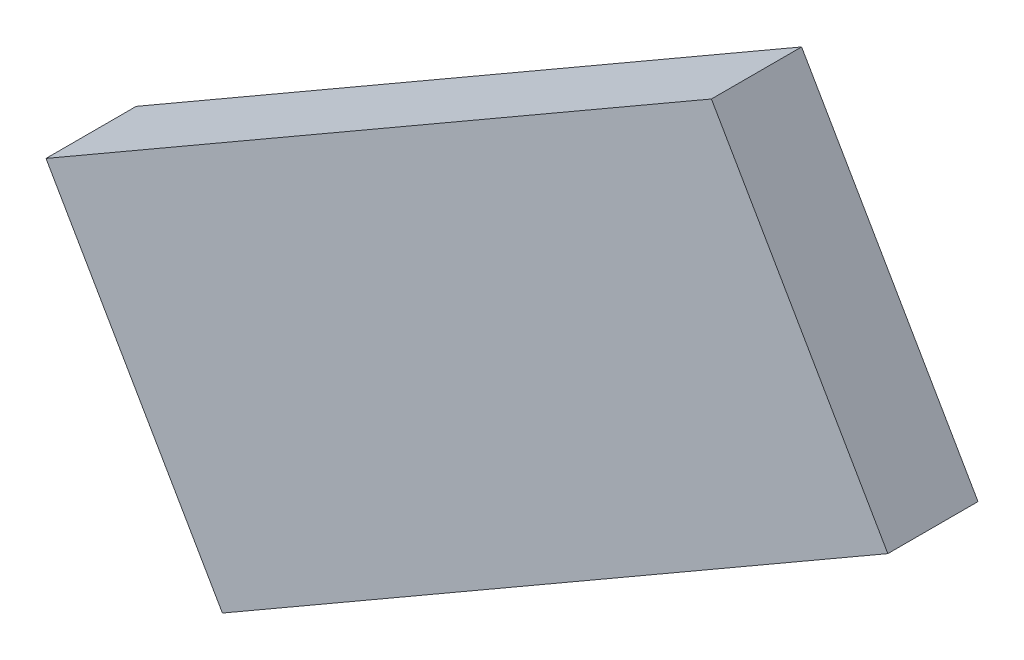
ISO-10303-21;
HEADER;
FILE_DESCRIPTION(('STEP AP214'),'2;1');
FILE_NAME('part.step','',(''),(''),'','','');
FILE_SCHEMA(('AUTOMOTIVE_DESIGN { 1 0 10303 214 1 1 1 1 }'));
ENDSEC;
DATA;
#1=APPLICATION_CONTEXT('core data for automotive mechanical design processes');
#2=APPLICATION_PROTOCOL_DEFINITION('international standard','automotive_design',2000,#1);
#3=PRODUCT_CONTEXT('',#1,'mechanical');
#4=PRODUCT('Part','Part','',(#3));
#5=PRODUCT_RELATED_PRODUCT_CATEGORY('part','',(#4));
#6=PRODUCT_DEFINITION_FORMATION('','',#4);
#7=PRODUCT_DEFINITION_CONTEXT('part definition',#1,'design');
#8=PRODUCT_DEFINITION('design','',#6,#7);
#9=PRODUCT_DEFINITION_SHAPE('','',#8);
#10=(LENGTH_UNIT() NAMED_UNIT(*) SI_UNIT(.MILLI.,.METRE.));
#11=(NAMED_UNIT(*) PLANE_ANGLE_UNIT() SI_UNIT($,.RADIAN.));
#12=(NAMED_UNIT(*) SI_UNIT($,.STERADIAN.) SOLID_ANGLE_UNIT());
#13=UNCERTAINTY_MEASURE_WITH_UNIT(LENGTH_MEASURE(1.E-05),#10,'distance_accuracy_value','');
#14=(GEOMETRIC_REPRESENTATION_CONTEXT(3) GLOBAL_UNCERTAINTY_ASSIGNED_CONTEXT((#13)) GLOBAL_UNIT_ASSIGNED_CONTEXT((#10,
#11,#12)) REPRESENTATION_CONTEXT('',''));
#15=CARTESIAN_POINT('',(0.,0.,0.));
#16=DIRECTION('',(0.,0.,1.));
#17=DIRECTION('',(1.,0.,0.));
#18=AXIS2_PLACEMENT_3D('',#15,#16,#17);
#19=CARTESIAN_POINT('',(3.1185231,4.39856118,1.15000024));
#20=DIRECTION('',(0.,0.,-1.));
#21=DIRECTION('',(-1.,0.,0.));
#22=AXIS2_PLACEMENT_3D('',#19,#20,#21);
#23=PLANE('',#22);
#24=DIRECTION('',(-0.500000090607198,0.866025351472342,0.));
#25=VECTOR('',#24,1.);
#26=CARTESIAN_POINT('',(-5.36852368,-0.50144426,1.15000024));
#27=LINE('',#26,#25);
#28=CARTESIAN_POINT('',(-5.36852367999986,-0.501444260000241,1.15000024));
#29=VERTEX_POINT('',#28);
#30=CARTESIAN_POINT('',(-3.11852310000019,-4.39855864000011,1.15000024));
#31=VERTEX_POINT('',#30);
#32=EDGE_CURVE('E56',#29,#31,#27,.F.);
#33=ORIENTED_EDGE('',*,*,#32,.T.);
#34=DIRECTION('',(-0.866025397135755,-0.500000011515858,0.));
#35=VECTOR('',#34,1.);
#36=CARTESIAN_POINT('',(-3.1185231,-4.39855864,1.15000024));
#37=LINE('',#36,#35);
#38=CARTESIAN_POINT('',(5.36852621999984,0.501441720000285,1.15000024));
#39=VERTEX_POINT('',#38);
#40=EDGE_CURVE('E60',#31,#39,#37,.F.);
#41=ORIENTED_EDGE('',*,*,#40,.T.);
#42=DIRECTION('',(0.500000025117057,-0.866025389283099,0.));
#43=VECTOR('',#42,1.);
#44=CARTESIAN_POINT('',(5.36852622,0.50144172,1.15000024));
#45=LINE('',#44,#43);
#46=CARTESIAN_POINT('',(3.11852310000087,4.3985611800005,1.15000024));
#47=VERTEX_POINT('',#46);
#48=EDGE_CURVE('E20',#39,#47,#45,.F.);
#49=ORIENTED_EDGE('',*,*,#48,.T.);
#50=DIRECTION('',(0.866025107880074,0.500000512521043,0.));
#51=VECTOR('',#50,1.);
#52=CARTESIAN_POINT('',(3.1185231,4.39856118,1.15000024));
#53=LINE('',#52,#51);
#54=EDGE_CURVE('E88',#47,#29,#53,.F.);
#55=ORIENTED_EDGE('',*,*,#54,.T.);
#56=EDGE_LOOP('',(#33,#41,#49,#55));
#57=FACE_BOUND('',#56,.T.);
#58=ADVANCED_FACE('F17',(#57),#23,.F.);
#59=CARTESIAN_POINT('',(5.36852622,0.50144172,0.));
#60=DIRECTION('',(-0.866025389283099,-0.500000025117057,0.));
#61=DIRECTION('',(0.500000025117057,-0.866025389283099,0.));
#62=AXIS2_PLACEMENT_3D('',#59,#60,#61);
#63=PLANE('',#62);
#64=DIRECTION('',(0.,0.,1.));
#65=VECTOR('',#64,1.);
#66=CARTESIAN_POINT('',(3.1185231,4.39856118,0.));
#67=LINE('',#66,#65);
#68=CARTESIAN_POINT('',(3.11852310000087,4.3985611800005,0.));
#69=VERTEX_POINT('',#68);
#70=EDGE_CURVE('E72',#69,#47,#67,.T.);
#71=ORIENTED_EDGE('',*,*,#70,.T.);
#72=ORIENTED_EDGE('',*,*,#48,.F.);
#73=DIRECTION('',(0.,0.,1.));
#74=VECTOR('',#73,1.);
#75=CARTESIAN_POINT('',(5.36852621999934,0.501441720001141,0.));
#76=LINE('',#75,#74);
#77=CARTESIAN_POINT('',(5.36852621999984,0.501441720000285,0.));
#78=VERTEX_POINT('',#77);
#79=EDGE_CURVE('E67',#39,#78,#76,.F.);
#80=ORIENTED_EDGE('',*,*,#79,.T.);
#81=DIRECTION('',(0.500000025117445,-0.866025389282875,0.));
#82=VECTOR('',#81,1.);
#83=CARTESIAN_POINT('',(3.1185231,4.39856118,0.));
#84=LINE('',#83,#82);
#85=EDGE_CURVE('E91',#69,#78,#84,.T.);
#86=ORIENTED_EDGE('',*,*,#85,.F.);
#87=EDGE_LOOP('',(#71,#72,#80,#86));
#88=FACE_BOUND('',#87,.T.);
#89=ADVANCED_FACE('F69',(#88),#63,.F.);
#90=CARTESIAN_POINT('',(-3.1185231,-4.39855864,0.));
#91=DIRECTION('',(-0.500000011515858,0.866025397135755,0.));
#92=DIRECTION('',(-0.866025397135755,-0.500000011515858,0.));
#93=AXIS2_PLACEMENT_3D('',#90,#91,#92);
#94=PLANE('',#93);
#95=ORIENTED_EDGE('',*,*,#79,.F.);
#96=ORIENTED_EDGE('',*,*,#40,.F.);
#97=DIRECTION('',(0.,0.,1.));
#98=VECTOR('',#97,1.);
#99=CARTESIAN_POINT('',(-3.11852310000074,-4.39855864000043,0.));
#100=LINE('',#99,#98);
#101=CARTESIAN_POINT('',(-3.11852310000019,-4.39855864000011,0.));
#102=VERTEX_POINT('',#101);
#103=EDGE_CURVE('E83',#31,#102,#100,.F.);
#104=ORIENTED_EDGE('',*,*,#103,.T.);
#105=DIRECTION('',(-0.866025397135822,-0.500000011515742,0.));
#106=VECTOR('',#105,1.);
#107=CARTESIAN_POINT('',(5.36852622,0.50144172,0.));
#108=LINE('',#107,#106);
#109=EDGE_CURVE('E77',#78,#102,#108,.T.);
#110=ORIENTED_EDGE('',*,*,#109,.F.);
#111=EDGE_LOOP('',(#95,#96,#104,#110));
#112=FACE_BOUND('',#111,.T.);
#113=ADVANCED_FACE('F75',(#112),#94,.F.);
#114=CARTESIAN_POINT('',(-5.36852368,-0.50144426,0.));
#115=DIRECTION('',(0.866025351472342,0.500000090607198,0.));
#116=DIRECTION('',(-0.500000090607198,0.866025351472342,0.));
#117=AXIS2_PLACEMENT_3D('',#114,#115,#116);
#118=PLANE('',#117);
#119=ORIENTED_EDGE('',*,*,#103,.F.);
#120=ORIENTED_EDGE('',*,*,#32,.F.);
#121=DIRECTION('',(0.,0.,1.));
#122=VECTOR('',#121,1.);
#123=CARTESIAN_POINT('',(-5.36852367999944,-0.501444260000966,0.));
#124=LINE('',#123,#122);
#125=CARTESIAN_POINT('',(-5.36852367999986,-0.501444260000241,0.));
#126=VERTEX_POINT('',#125);
#127=EDGE_CURVE('E35',#29,#126,#124,.F.);
#128=ORIENTED_EDGE('',*,*,#127,.T.);
#129=DIRECTION('',(-0.500000090607363,0.866025351472247,0.));
#130=VECTOR('',#129,1.);
#131=CARTESIAN_POINT('',(-3.1185231,-4.39855864,0.));
#132=LINE('',#131,#130);
#133=EDGE_CURVE('E26',#102,#126,#132,.T.);
#134=ORIENTED_EDGE('',*,*,#133,.F.);
#135=EDGE_LOOP('',(#119,#120,#128,#134));
#136=FACE_BOUND('',#135,.T.);
#137=ADVANCED_FACE('F98',(#136),#118,.F.);
#138=CARTESIAN_POINT('',(3.1185231,4.39856118,0.));
#139=DIRECTION('',(0.500000512521043,-0.866025107880074,0.));
#140=DIRECTION('',(0.866025107880074,0.500000512521043,0.));
#141=AXIS2_PLACEMENT_3D('',#138,#139,#140);
#142=PLANE('',#141);
#143=ORIENTED_EDGE('',*,*,#127,.F.);
#144=ORIENTED_EDGE('',*,*,#54,.F.);
#145=ORIENTED_EDGE('',*,*,#70,.F.);
#146=DIRECTION('',(0.866025107880131,0.500000512520944,0.));
#147=VECTOR('',#146,1.);
#148=CARTESIAN_POINT('',(-5.36852368,-0.50144426,0.));
#149=LINE('',#148,#147);
#150=EDGE_CURVE('E11',#126,#69,#149,.T.);
#151=ORIENTED_EDGE('',*,*,#150,.F.);
#152=EDGE_LOOP('',(#143,#144,#145,#151));
#153=FACE_BOUND('',#152,.T.);
#154=ADVANCED_FACE('F100',(#153),#142,.F.);
#155=CARTESIAN_POINT('',(3.1185231,4.39856118,0.));
#156=DIRECTION('',(0.,0.,-1.));
#157=DIRECTION('',(-1.,0.,0.));
#158=AXIS2_PLACEMENT_3D('',#155,#156,#157);
#159=PLANE('',#158);
#160=ORIENTED_EDGE('',*,*,#133,.T.);
#161=ORIENTED_EDGE('',*,*,#150,.T.);
#162=ORIENTED_EDGE('',*,*,#85,.T.);
#163=ORIENTED_EDGE('',*,*,#109,.T.);
#164=EDGE_LOOP('',(#160,#161,#162,#163));
#165=FACE_BOUND('',#164,.T.);
#166=ADVANCED_FACE('F97',(#165),#159,.T.);
#167=CLOSED_SHELL('',(#58,#89,#113,#137,#154,#166));
#168=MANIFOLD_SOLID_BREP('B1',#167);
#169=ADVANCED_BREP_SHAPE_REPRESENTATION('',(#18,#168),#14);
#170=SHAPE_DEFINITION_REPRESENTATION(#9,#169);
ENDSEC;
END-ISO-10303-21;
